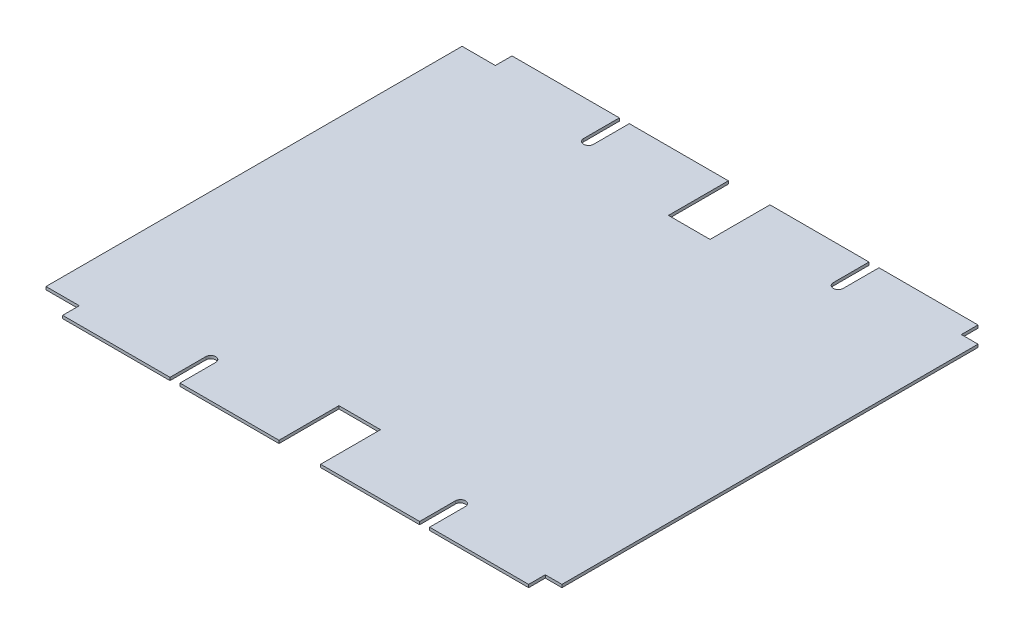
ISO-10303-21;
HEADER;
FILE_DESCRIPTION(('STEP AP214'),'2;1');
FILE_NAME('part.step','',(''),(''),'','','');
FILE_SCHEMA(('AUTOMOTIVE_DESIGN { 1 0 10303 214 1 1 1 1 }'));
ENDSEC;
DATA;
#1=APPLICATION_CONTEXT('core data for automotive mechanical design processes');
#2=APPLICATION_PROTOCOL_DEFINITION('international standard','automotive_design',2000,#1);
#3=PRODUCT_CONTEXT('',#1,'mechanical');
#4=PRODUCT('Part','Part','',(#3));
#5=PRODUCT_RELATED_PRODUCT_CATEGORY('part','',(#4));
#6=PRODUCT_DEFINITION_FORMATION('','',#4);
#7=PRODUCT_DEFINITION_CONTEXT('part definition',#1,'design');
#8=PRODUCT_DEFINITION('design','',#6,#7);
#9=PRODUCT_DEFINITION_SHAPE('','',#8);
#10=(LENGTH_UNIT() NAMED_UNIT(*) SI_UNIT(.MILLI.,.METRE.));
#11=(NAMED_UNIT(*) PLANE_ANGLE_UNIT() SI_UNIT($,.RADIAN.));
#12=(NAMED_UNIT(*) SI_UNIT($,.STERADIAN.) SOLID_ANGLE_UNIT());
#13=UNCERTAINTY_MEASURE_WITH_UNIT(LENGTH_MEASURE(1.E-05),#10,'distance_accuracy_value','');
#14=(GEOMETRIC_REPRESENTATION_CONTEXT(3) GLOBAL_UNCERTAINTY_ASSIGNED_CONTEXT((#13)) GLOBAL_UNIT_ASSIGNED_CONTEXT((#10,
#11,#12)) REPRESENTATION_CONTEXT('',''));
#15=CARTESIAN_POINT('',(0.,0.,0.));
#16=DIRECTION('',(0.,0.,1.));
#17=DIRECTION('',(1.,0.,0.));
#18=AXIS2_PLACEMENT_3D('',#15,#16,#17);
#19=CARTESIAN_POINT('',(-280.,3.5,270.));
#20=DIRECTION('',(0.,0.,-1.));
#21=DIRECTION('',(-1.,0.,0.));
#22=AXIS2_PLACEMENT_3D('',#19,#20,#21);
#23=PLANE('',#22);
#24=DIRECTION('',(1.,0.,0.));
#25=VECTOR('',#24,1.);
#26=CARTESIAN_POINT('',(-280.,3.5,270.));
#27=LINE('',#26,#25);
#28=CARTESIAN_POINT('',(-139.,3.5,270.));
#29=VERTEX_POINT('',#28);
#30=CARTESIAN_POINT('',(-19.9999999999999,3.5,270.));
#31=VERTEX_POINT('',#30);
#32=EDGE_CURVE('E412',#29,#31,#27,.T.);
#33=ORIENTED_EDGE('',*,*,#32,.F.);
#34=DIRECTION('',(0.,1.,0.));
#35=VECTOR('',#34,1.);
#36=CARTESIAN_POINT('',(-139.,-6.5,270.));
#37=LINE('',#36,#35);
#38=CARTESIAN_POINT('',(-139.,0.,270.));
#39=VERTEX_POINT('',#38);
#40=EDGE_CURVE('E316',#39,#29,#37,.T.);
#41=ORIENTED_EDGE('',*,*,#40,.F.);
#42=DIRECTION('',(1.,0.,0.));
#43=VECTOR('',#42,1.);
#44=CARTESIAN_POINT('',(-280.,0.,270.));
#45=LINE('',#44,#43);
#46=CARTESIAN_POINT('',(-19.9999999999999,0.,270.));
#47=VERTEX_POINT('',#46);
#48=EDGE_CURVE('E443',#39,#47,#45,.T.);
#49=ORIENTED_EDGE('',*,*,#48,.T.);
#50=DIRECTION('',(0.,1.,0.));
#51=VECTOR('',#50,1.);
#52=CARTESIAN_POINT('',(-19.9999999999999,-6.5,270.));
#53=LINE('',#52,#51);
#54=EDGE_CURVE('E389',#47,#31,#53,.T.);
#55=ORIENTED_EDGE('',*,*,#54,.T.);
#56=EDGE_LOOP('',(#33,#41,#49,#55));
#57=FACE_BOUND('',#56,.T.);
#58=ADVANCED_FACE('F37',(#57),#23,.F.);
#59=CARTESIAN_POINT('',(-280.,3.5,-270.));
#60=DIRECTION('',(0.,0.,1.));
#61=DIRECTION('',(1.,0.,0.));
#62=AXIS2_PLACEMENT_3D('',#59,#60,#61);
#63=PLANE('',#62);
#64=DIRECTION('',(-1.,0.,0.));
#65=VECTOR('',#64,1.);
#66=CARTESIAN_POINT('',(-280.,3.5,-270.));
#67=LINE('',#66,#65);
#68=CARTESIAN_POINT('',(-151.,3.5,-270.));
#69=VERTEX_POINT('',#68);
#70=CARTESIAN_POINT('',(-280.,3.5,-270.));
#71=VERTEX_POINT('',#70);
#72=EDGE_CURVE('E421',#69,#71,#67,.T.);
#73=ORIENTED_EDGE('',*,*,#72,.F.);
#74=DIRECTION('',(0.,1.,0.));
#75=VECTOR('',#74,1.);
#76=CARTESIAN_POINT('',(-151.,-6.5,-270.));
#77=LINE('',#76,#75);
#78=CARTESIAN_POINT('',(-151.,0.,-270.));
#79=VERTEX_POINT('',#78);
#80=EDGE_CURVE('E332',#79,#69,#77,.T.);
#81=ORIENTED_EDGE('',*,*,#80,.F.);
#82=DIRECTION('',(-1.,0.,0.));
#83=VECTOR('',#82,1.);
#84=CARTESIAN_POINT('',(-280.,0.,-270.));
#85=LINE('',#84,#83);
#86=CARTESIAN_POINT('',(-280.,0.,-270.));
#87=VERTEX_POINT('',#86);
#88=EDGE_CURVE('E453',#79,#87,#85,.T.);
#89=ORIENTED_EDGE('',*,*,#88,.T.);
#90=DIRECTION('',(0.,-1.,0.));
#91=VECTOR('',#90,1.);
#92=CARTESIAN_POINT('',(-280.,3.5,-270.));
#93=LINE('',#92,#91);
#94=EDGE_CURVE('E425',#71,#87,#93,.T.);
#95=ORIENTED_EDGE('',*,*,#94,.F.);
#96=EDGE_LOOP('',(#73,#81,#89,#95));
#97=FACE_BOUND('',#96,.T.);
#98=ADVANCED_FACE('F557',(#97),#63,.F.);
#99=CARTESIAN_POINT('',(161.,3.5,270.));
#100=VERTEX_POINT('',#99);
#101=CARTESIAN_POINT('',(280.,3.5,270.));
#102=VERTEX_POINT('',#101);
#103=EDGE_CURVE('E407',#100,#102,#27,.T.);
#104=ORIENTED_EDGE('',*,*,#103,.F.);
#105=DIRECTION('',(0.,1.,0.));
#106=VECTOR('',#105,1.);
#107=CARTESIAN_POINT('',(161.,-6.5,270.));
#108=LINE('',#107,#106);
#109=CARTESIAN_POINT('',(161.,0.,270.));
#110=VERTEX_POINT('',#109);
#111=EDGE_CURVE('E302',#110,#100,#108,.T.);
#112=ORIENTED_EDGE('',*,*,#111,.F.);
#113=CARTESIAN_POINT('',(280.,0.,270.));
#114=VERTEX_POINT('',#113);
#115=EDGE_CURVE('E438',#110,#114,#45,.T.);
#116=ORIENTED_EDGE('',*,*,#115,.T.);
#117=DIRECTION('',(0.,-1.,0.));
#118=VECTOR('',#117,1.);
#119=CARTESIAN_POINT('',(280.,3.5,270.));
#120=LINE('',#119,#118);
#121=EDGE_CURVE('E469',#102,#114,#120,.T.);
#122=ORIENTED_EDGE('',*,*,#121,.F.);
#123=EDGE_LOOP('',(#104,#112,#116,#122));
#124=FACE_BOUND('',#123,.T.);
#125=ADVANCED_FACE('F601',(#124),#23,.F.);
#126=CARTESIAN_POINT('',(149.,3.5,-270.));
#127=VERTEX_POINT('',#126);
#128=CARTESIAN_POINT('',(30.0000000000001,3.5,-270.));
#129=VERTEX_POINT('',#128);
#130=EDGE_CURVE('E426',#127,#129,#67,.T.);
#131=ORIENTED_EDGE('',*,*,#130,.F.);
#132=DIRECTION('',(0.,1.,0.));
#133=VECTOR('',#132,1.);
#134=CARTESIAN_POINT('',(149.,-6.5,-270.));
#135=LINE('',#134,#133);
#136=CARTESIAN_POINT('',(149.,0.,-270.));
#137=VERTEX_POINT('',#136);
#138=EDGE_CURVE('E347',#137,#127,#135,.T.);
#139=ORIENTED_EDGE('',*,*,#138,.F.);
#140=CARTESIAN_POINT('',(30.0000000000001,0.,-270.));
#141=VERTEX_POINT('',#140);
#142=EDGE_CURVE('E456',#137,#141,#85,.T.);
#143=ORIENTED_EDGE('',*,*,#142,.T.);
#144=DIRECTION('',(0.,1.,0.));
#145=VECTOR('',#144,1.);
#146=CARTESIAN_POINT('',(30.0000000000001,-6.5,-270.));
#147=LINE('',#146,#145);
#148=EDGE_CURVE('E368',#141,#129,#147,.T.);
#149=ORIENTED_EDGE('',*,*,#148,.T.);
#150=EDGE_LOOP('',(#131,#139,#143,#149));
#151=FACE_BOUND('',#150,.T.);
#152=ADVANCED_FACE('F579',(#151),#63,.F.);
#153=CARTESIAN_POINT('',(-280.,0.,270.));
#154=VERTEX_POINT('',#153);
#155=CARTESIAN_POINT('',(-151.,0.,270.));
#156=VERTEX_POINT('',#155);
#157=EDGE_CURVE('E439',#154,#156,#45,.T.);
#158=ORIENTED_EDGE('',*,*,#157,.T.);
#159=DIRECTION('',(0.,1.,0.));
#160=VECTOR('',#159,1.);
#161=CARTESIAN_POINT('',(-151.,-6.5,270.));
#162=LINE('',#161,#160);
#163=CARTESIAN_POINT('',(-151.,3.5,270.));
#164=VERTEX_POINT('',#163);
#165=EDGE_CURVE('E318',#156,#164,#162,.T.);
#166=ORIENTED_EDGE('',*,*,#165,.T.);
#167=CARTESIAN_POINT('',(-280.,3.5,270.));
#168=VERTEX_POINT('',#167);
#169=EDGE_CURVE('E408',#168,#164,#27,.T.);
#170=ORIENTED_EDGE('',*,*,#169,.F.);
#171=DIRECTION('',(0.,-1.,0.));
#172=VECTOR('',#171,1.);
#173=CARTESIAN_POINT('',(-280.,3.5,270.));
#174=LINE('',#173,#172);
#175=EDGE_CURVE('E472',#168,#154,#174,.T.);
#176=ORIENTED_EDGE('',*,*,#175,.T.);
#177=EDGE_LOOP('',(#158,#166,#170,#176));
#178=FACE_BOUND('',#177,.T.);
#179=ADVANCED_FACE('F613',(#178),#23,.F.);
#180=CARTESIAN_POINT('',(-19.9999999999999,0.,-270.));
#181=VERTEX_POINT('',#180);
#182=CARTESIAN_POINT('',(-139.,0.,-270.));
#183=VERTEX_POINT('',#182);
#184=EDGE_CURVE('E457',#181,#183,#85,.T.);
#185=ORIENTED_EDGE('',*,*,#184,.T.);
#186=DIRECTION('',(0.,1.,0.));
#187=VECTOR('',#186,1.);
#188=CARTESIAN_POINT('',(-139.,-6.5,-270.));
#189=LINE('',#188,#187);
#190=CARTESIAN_POINT('',(-139.,3.5,-270.));
#191=VERTEX_POINT('',#190);
#192=EDGE_CURVE('E60',#183,#191,#189,.T.);
#193=ORIENTED_EDGE('',*,*,#192,.T.);
#194=CARTESIAN_POINT('',(-19.9999999999999,3.5,-270.));
#195=VERTEX_POINT('',#194);
#196=EDGE_CURVE('E427',#195,#191,#67,.T.);
#197=ORIENTED_EDGE('',*,*,#196,.F.);
#198=DIRECTION('',(0.,1.,0.));
#199=VECTOR('',#198,1.);
#200=CARTESIAN_POINT('',(-19.9999999999999,-6.5,-270.));
#201=LINE('',#200,#199);
#202=EDGE_CURVE('E355',#181,#195,#201,.T.);
#203=ORIENTED_EDGE('',*,*,#202,.F.);
#204=EDGE_LOOP('',(#185,#193,#197,#203));
#205=FACE_BOUND('',#204,.T.);
#206=ADVANCED_FACE('F553',(#205),#63,.F.);
#207=CARTESIAN_POINT('',(-280.,3.5,-270.));
#208=DIRECTION('',(1.,0.,0.));
#209=DIRECTION('',(0.,0.,-1.));
#210=AXIS2_PLACEMENT_3D('',#207,#208,#209);
#211=PLANE('',#210);
#212=DIRECTION('',(0.,0.,1.));
#213=VECTOR('',#212,1.);
#214=CARTESIAN_POINT('',(-280.,0.,-270.));
#215=LINE('',#214,#213);
#216=CARTESIAN_POINT('',(-280.,0.,-250.));
#217=VERTEX_POINT('',#216);
#218=EDGE_CURVE('E388',#87,#217,#215,.T.);
#219=ORIENTED_EDGE('',*,*,#218,.T.);
#220=DIRECTION('',(0.,-1.,0.));
#221=VECTOR('',#220,1.);
#222=CARTESIAN_POINT('',(-280.,3.5,-250.));
#223=LINE('',#222,#221);
#224=CARTESIAN_POINT('',(-280.,3.5,-250.));
#225=VERTEX_POINT('',#224);
#226=EDGE_CURVE('E484',#225,#217,#223,.T.);
#227=ORIENTED_EDGE('',*,*,#226,.F.);
#228=DIRECTION('',(0.,0.,1.));
#229=VECTOR('',#228,1.);
#230=CARTESIAN_POINT('',(-280.,3.5,-270.));
#231=LINE('',#230,#229);
#232=EDGE_CURVE('E395',#71,#225,#231,.T.);
#233=ORIENTED_EDGE('',*,*,#232,.F.);
#234=ORIENTED_EDGE('',*,*,#94,.T.);
#235=EDGE_LOOP('',(#219,#227,#233,#234));
#236=FACE_BOUND('',#235,.T.);
#237=ADVANCED_FACE('F39',(#236),#211,.F.);
#238=CARTESIAN_POINT('',(-320.,3.5,-250.));
#239=DIRECTION('',(0.,0.,1.));
#240=DIRECTION('',(1.,0.,0.));
#241=AXIS2_PLACEMENT_3D('',#238,#239,#240);
#242=PLANE('',#241);
#243=DIRECTION('',(-1.,0.,0.));
#244=VECTOR('',#243,1.);
#245=CARTESIAN_POINT('',(-320.,0.,-250.));
#246=LINE('',#245,#244);
#247=CARTESIAN_POINT('',(-320.,0.,-250.));
#248=VERTEX_POINT('',#247);
#249=EDGE_CURVE('E430',#217,#248,#246,.T.);
#250=ORIENTED_EDGE('',*,*,#249,.T.);
#251=DIRECTION('',(0.,-1.,0.));
#252=VECTOR('',#251,1.);
#253=CARTESIAN_POINT('',(-320.,3.5,-250.));
#254=LINE('',#253,#252);
#255=CARTESIAN_POINT('',(-320.,3.5,-250.));
#256=VERTEX_POINT('',#255);
#257=EDGE_CURVE('E481',#256,#248,#254,.T.);
#258=ORIENTED_EDGE('',*,*,#257,.F.);
#259=DIRECTION('',(-1.,0.,0.));
#260=VECTOR('',#259,1.);
#261=CARTESIAN_POINT('',(-320.,3.5,-250.));
#262=LINE('',#261,#260);
#263=EDGE_CURVE('E398',#225,#256,#262,.T.);
#264=ORIENTED_EDGE('',*,*,#263,.F.);
#265=ORIENTED_EDGE('',*,*,#226,.T.);
#266=EDGE_LOOP('',(#250,#258,#264,#265));
#267=FACE_BOUND('',#266,.T.);
#268=ADVANCED_FACE('F566',(#267),#242,.F.);
#269=CARTESIAN_POINT('',(-320.,3.5,-250.));
#270=DIRECTION('',(1.,0.,0.));
#271=DIRECTION('',(0.,0.,-1.));
#272=AXIS2_PLACEMENT_3D('',#269,#270,#271);
#273=PLANE('',#272);
#274=DIRECTION('',(0.,0.,1.));
#275=VECTOR('',#274,1.);
#276=CARTESIAN_POINT('',(-320.,0.,-250.));
#277=LINE('',#276,#275);
#278=CARTESIAN_POINT('',(-320.,0.,250.));
#279=VERTEX_POINT('',#278);
#280=EDGE_CURVE('E432',#248,#279,#277,.T.);
#281=ORIENTED_EDGE('',*,*,#280,.T.);
#282=DIRECTION('',(0.,-1.,0.));
#283=VECTOR('',#282,1.);
#284=CARTESIAN_POINT('',(-320.,3.5,250.));
#285=LINE('',#284,#283);
#286=CARTESIAN_POINT('',(-320.,3.5,250.));
#287=VERTEX_POINT('',#286);
#288=EDGE_CURVE('E478',#287,#279,#285,.T.);
#289=ORIENTED_EDGE('',*,*,#288,.F.);
#290=DIRECTION('',(0.,0.,1.));
#291=VECTOR('',#290,1.);
#292=CARTESIAN_POINT('',(-320.,3.5,-250.));
#293=LINE('',#292,#291);
#294=EDGE_CURVE('E401',#256,#287,#293,.T.);
#295=ORIENTED_EDGE('',*,*,#294,.F.);
#296=ORIENTED_EDGE('',*,*,#257,.T.);
#297=EDGE_LOOP('',(#281,#289,#295,#296));
#298=FACE_BOUND('',#297,.T.);
#299=ADVANCED_FACE('F652',(#298),#273,.F.);
#300=CARTESIAN_POINT('',(-320.,3.5,250.));
#301=DIRECTION('',(0.,0.,-1.));
#302=DIRECTION('',(-1.,0.,0.));
#303=AXIS2_PLACEMENT_3D('',#300,#301,#302);
#304=PLANE('',#303);
#305=DIRECTION('',(1.,0.,0.));
#306=VECTOR('',#305,1.);
#307=CARTESIAN_POINT('',(-320.,0.,250.));
#308=LINE('',#307,#306);
#309=CARTESIAN_POINT('',(-280.,0.,250.));
#310=VERTEX_POINT('',#309);
#311=EDGE_CURVE('E434',#279,#310,#308,.T.);
#312=ORIENTED_EDGE('',*,*,#311,.T.);
#313=DIRECTION('',(0.,-1.,0.));
#314=VECTOR('',#313,1.);
#315=CARTESIAN_POINT('',(-280.,3.5,250.));
#316=LINE('',#315,#314);
#317=CARTESIAN_POINT('',(-280.,3.5,250.));
#318=VERTEX_POINT('',#317);
#319=EDGE_CURVE('E475',#318,#310,#316,.T.);
#320=ORIENTED_EDGE('',*,*,#319,.F.);
#321=DIRECTION('',(1.,0.,0.));
#322=VECTOR('',#321,1.);
#323=CARTESIAN_POINT('',(-320.,3.5,250.));
#324=LINE('',#323,#322);
#325=EDGE_CURVE('E403',#287,#318,#324,.T.);
#326=ORIENTED_EDGE('',*,*,#325,.F.);
#327=ORIENTED_EDGE('',*,*,#288,.T.);
#328=EDGE_LOOP('',(#312,#320,#326,#327));
#329=FACE_BOUND('',#328,.T.);
#330=ADVANCED_FACE('F624',(#329),#304,.F.);
#331=CARTESIAN_POINT('',(-280.,3.5,270.));
#332=DIRECTION('',(1.,0.,0.));
#333=DIRECTION('',(0.,0.,-1.));
#334=AXIS2_PLACEMENT_3D('',#331,#332,#333);
#335=PLANE('',#334);
#336=DIRECTION('',(0.,0.,1.));
#337=VECTOR('',#336,1.);
#338=CARTESIAN_POINT('',(-280.,0.,270.));
#339=LINE('',#338,#337);
#340=EDGE_CURVE('E436',#310,#154,#339,.T.);
#341=ORIENTED_EDGE('',*,*,#340,.T.);
#342=ORIENTED_EDGE('',*,*,#175,.F.);
#343=DIRECTION('',(0.,0.,1.));
#344=VECTOR('',#343,1.);
#345=CARTESIAN_POINT('',(-280.,3.5,270.));
#346=LINE('',#345,#344);
#347=EDGE_CURVE('E405',#318,#168,#346,.T.);
#348=ORIENTED_EDGE('',*,*,#347,.F.);
#349=ORIENTED_EDGE('',*,*,#319,.T.);
#350=EDGE_LOOP('',(#341,#342,#348,#349));
#351=FACE_BOUND('',#350,.T.);
#352=ADVANCED_FACE('F616',(#351),#335,.F.);
#353=CARTESIAN_POINT('',(30.0000000000001,0.,270.));
#354=VERTEX_POINT('',#353);
#355=CARTESIAN_POINT('',(149.,0.,270.));
#356=VERTEX_POINT('',#355);
#357=EDGE_CURVE('E444',#354,#356,#45,.T.);
#358=ORIENTED_EDGE('',*,*,#357,.T.);
#359=DIRECTION('',(0.,1.,0.));
#360=VECTOR('',#359,1.);
#361=CARTESIAN_POINT('',(149.,-6.5,270.));
#362=LINE('',#361,#360);
#363=CARTESIAN_POINT('',(149.,3.5,270.));
#364=VERTEX_POINT('',#363);
#365=EDGE_CURVE('E279',#356,#364,#362,.T.);
#366=ORIENTED_EDGE('',*,*,#365,.T.);
#367=CARTESIAN_POINT('',(30.0000000000001,3.5,270.));
#368=VERTEX_POINT('',#367);
#369=EDGE_CURVE('E296',#368,#364,#27,.T.);
#370=ORIENTED_EDGE('',*,*,#369,.F.);
#371=DIRECTION('',(0.,1.,0.));
#372=VECTOR('',#371,1.);
#373=CARTESIAN_POINT('',(30.0000000000001,-6.5,270.));
#374=LINE('',#373,#372);
#375=EDGE_CURVE('E386',#354,#368,#374,.T.);
#376=ORIENTED_EDGE('',*,*,#375,.F.);
#377=EDGE_LOOP('',(#358,#366,#370,#376));
#378=FACE_BOUND('',#377,.T.);
#379=ADVANCED_FACE('F602',(#378),#23,.F.);
#380=CARTESIAN_POINT('',(280.,3.5,270.));
#381=DIRECTION('',(-1.,0.,0.));
#382=DIRECTION('',(0.,0.,1.));
#383=AXIS2_PLACEMENT_3D('',#380,#381,#382);
#384=PLANE('',#383);
#385=DIRECTION('',(0.,0.,-1.));
#386=VECTOR('',#385,1.);
#387=CARTESIAN_POINT('',(280.,0.,270.));
#388=LINE('',#387,#386);
#389=CARTESIAN_POINT('',(280.,0.,250.));
#390=VERTEX_POINT('',#389);
#391=EDGE_CURVE('E442',#114,#390,#388,.T.);
#392=ORIENTED_EDGE('',*,*,#391,.T.);
#393=DIRECTION('',(0.,-1.,0.));
#394=VECTOR('',#393,1.);
#395=CARTESIAN_POINT('',(280.,3.5,250.));
#396=LINE('',#395,#394);
#397=CARTESIAN_POINT('',(280.,3.5,250.));
#398=VERTEX_POINT('',#397);
#399=EDGE_CURVE('E466',#398,#390,#396,.T.);
#400=ORIENTED_EDGE('',*,*,#399,.F.);
#401=DIRECTION('',(0.,0.,-1.));
#402=VECTOR('',#401,1.);
#403=CARTESIAN_POINT('',(280.,3.5,270.));
#404=LINE('',#403,#402);
#405=EDGE_CURVE('E411',#102,#398,#404,.T.);
#406=ORIENTED_EDGE('',*,*,#405,.F.);
#407=ORIENTED_EDGE('',*,*,#121,.T.);
#408=EDGE_LOOP('',(#392,#400,#406,#407));
#409=FACE_BOUND('',#408,.T.);
#410=ADVANCED_FACE('F615',(#409),#384,.F.);
#411=CARTESIAN_POINT('',(320.,3.5,250.));
#412=DIRECTION('',(0.,0.,-1.));
#413=DIRECTION('',(-1.,0.,0.));
#414=AXIS2_PLACEMENT_3D('',#411,#412,#413);
#415=PLANE('',#414);
#416=DIRECTION('',(1.,0.,0.));
#417=VECTOR('',#416,1.);
#418=CARTESIAN_POINT('',(320.,0.,250.));
#419=LINE('',#418,#417);
#420=CARTESIAN_POINT('',(300.,0.,250.));
#421=VERTEX_POINT('',#420);
#422=EDGE_CURVE('E446',#390,#421,#419,.T.);
#423=ORIENTED_EDGE('',*,*,#422,.T.);
#424=DIRECTION('',(0.,1.,0.));
#425=VECTOR('',#424,1.);
#426=CARTESIAN_POINT('',(300.,-6.5,250.));
#427=LINE('',#426,#425);
#428=CARTESIAN_POINT('',(300.,3.5,250.));
#429=VERTEX_POINT('',#428);
#430=EDGE_CURVE('E360',#421,#429,#427,.T.);
#431=ORIENTED_EDGE('',*,*,#430,.T.);
#432=DIRECTION('',(1.,0.,0.));
#433=VECTOR('',#432,1.);
#434=CARTESIAN_POINT('',(320.,3.5,250.));
#435=LINE('',#434,#433);
#436=EDGE_CURVE('E414',#398,#429,#435,.T.);
#437=ORIENTED_EDGE('',*,*,#436,.F.);
#438=ORIENTED_EDGE('',*,*,#399,.T.);
#439=EDGE_LOOP('',(#423,#431,#437,#438));
#440=FACE_BOUND('',#439,.T.);
#441=ADVANCED_FACE('F622',(#440),#415,.F.);
#442=CARTESIAN_POINT('',(320.,3.5,-250.));
#443=DIRECTION('',(0.,0.,1.));
#444=DIRECTION('',(1.,0.,0.));
#445=AXIS2_PLACEMENT_3D('',#442,#443,#444);
#446=PLANE('',#445);
#447=DIRECTION('',(-1.,0.,0.));
#448=VECTOR('',#447,1.);
#449=CARTESIAN_POINT('',(320.,3.5,-250.));
#450=LINE('',#449,#448);
#451=CARTESIAN_POINT('',(300.,3.5,-250.));
#452=VERTEX_POINT('',#451);
#453=CARTESIAN_POINT('',(280.,3.5,-250.));
#454=VERTEX_POINT('',#453);
#455=EDGE_CURVE('E417',#452,#454,#450,.T.);
#456=ORIENTED_EDGE('',*,*,#455,.F.);
#457=DIRECTION('',(0.,1.,0.));
#458=VECTOR('',#457,1.);
#459=CARTESIAN_POINT('',(300.,-6.5,-250.));
#460=LINE('',#459,#458);
#461=CARTESIAN_POINT('',(300.,0.,-250.));
#462=VERTEX_POINT('',#461);
#463=EDGE_CURVE('E351',#462,#452,#460,.T.);
#464=ORIENTED_EDGE('',*,*,#463,.F.);
#465=DIRECTION('',(-1.,0.,0.));
#466=VECTOR('',#465,1.);
#467=CARTESIAN_POINT('',(320.,0.,-250.));
#468=LINE('',#467,#466);
#469=CARTESIAN_POINT('',(280.,0.,-250.));
#470=VERTEX_POINT('',#469);
#471=EDGE_CURVE('E449',#462,#470,#468,.T.);
#472=ORIENTED_EDGE('',*,*,#471,.T.);
#473=DIRECTION('',(0.,-1.,0.));
#474=VECTOR('',#473,1.);
#475=CARTESIAN_POINT('',(280.,3.5,-250.));
#476=LINE('',#475,#474);
#477=EDGE_CURVE('E463',#454,#470,#476,.T.);
#478=ORIENTED_EDGE('',*,*,#477,.F.);
#479=EDGE_LOOP('',(#456,#464,#472,#478));
#480=FACE_BOUND('',#479,.T.);
#481=ADVANCED_FACE('F871',(#480),#446,.F.);
#482=CARTESIAN_POINT('',(280.,3.5,-270.));
#483=DIRECTION('',(-1.,0.,0.));
#484=DIRECTION('',(0.,0.,1.));
#485=AXIS2_PLACEMENT_3D('',#482,#483,#484);
#486=PLANE('',#485);
#487=DIRECTION('',(0.,0.,-1.));
#488=VECTOR('',#487,1.);
#489=CARTESIAN_POINT('',(280.,0.,-270.));
#490=LINE('',#489,#488);
#491=CARTESIAN_POINT('',(280.,0.,-270.));
#492=VERTEX_POINT('',#491);
#493=EDGE_CURVE('E451',#470,#492,#490,.T.);
#494=ORIENTED_EDGE('',*,*,#493,.T.);
#495=DIRECTION('',(0.,-1.,0.));
#496=VECTOR('',#495,1.);
#497=CARTESIAN_POINT('',(280.,3.5,-270.));
#498=LINE('',#497,#496);
#499=CARTESIAN_POINT('',(280.,3.5,-270.));
#500=VERTEX_POINT('',#499);
#501=EDGE_CURVE('E460',#500,#492,#498,.T.);
#502=ORIENTED_EDGE('',*,*,#501,.F.);
#503=DIRECTION('',(0.,0.,-1.));
#504=VECTOR('',#503,1.);
#505=CARTESIAN_POINT('',(280.,3.5,-270.));
#506=LINE('',#505,#504);
#507=EDGE_CURVE('E419',#454,#500,#506,.T.);
#508=ORIENTED_EDGE('',*,*,#507,.F.);
#509=ORIENTED_EDGE('',*,*,#477,.T.);
#510=EDGE_LOOP('',(#494,#502,#508,#509));
#511=FACE_BOUND('',#510,.T.);
#512=ADVANCED_FACE('F688',(#511),#486,.F.);
#513=CARTESIAN_POINT('',(161.,0.,-270.));
#514=VERTEX_POINT('',#513);
#515=EDGE_CURVE('E399',#492,#514,#85,.T.);
#516=ORIENTED_EDGE('',*,*,#515,.T.);
#517=DIRECTION('',(0.,1.,0.));
#518=VECTOR('',#517,1.);
#519=CARTESIAN_POINT('',(161.,-6.5,-270.));
#520=LINE('',#519,#518);
#521=CARTESIAN_POINT('',(161.,3.5,-270.));
#522=VERTEX_POINT('',#521);
#523=EDGE_CURVE('E52',#514,#522,#520,.T.);
#524=ORIENTED_EDGE('',*,*,#523,.T.);
#525=EDGE_CURVE('E422',#500,#522,#67,.T.);
#526=ORIENTED_EDGE('',*,*,#525,.F.);
#527=ORIENTED_EDGE('',*,*,#501,.T.);
#528=EDGE_LOOP('',(#516,#524,#526,#527));
#529=FACE_BOUND('',#528,.T.);
#530=ADVANCED_FACE('F607',(#529),#63,.F.);
#531=CARTESIAN_POINT('',(0.,3.5,0.));
#532=DIRECTION('',(0.,1.,0.));
#533=DIRECTION('',(0.,0.,1.));
#534=AXIS2_PLACEMENT_3D('',#531,#532,#533);
#535=PLANE('',#534);
#536=DIRECTION('',(0.,0.,1.));
#537=VECTOR('',#536,1.);
#538=CARTESIAN_POINT('',(300.,3.5,250.));
#539=LINE('',#538,#537);
#540=EDGE_CURVE('E346',#452,#429,#539,.T.);
#541=ORIENTED_EDGE('',*,*,#540,.F.);
#542=ORIENTED_EDGE('',*,*,#455,.T.);
#543=ORIENTED_EDGE('',*,*,#507,.T.);
#544=ORIENTED_EDGE('',*,*,#525,.T.);
#545=DIRECTION('',(0.,0.,-1.));
#546=VECTOR('',#545,1.);
#547=CARTESIAN_POINT('',(161.,3.5,-227.));
#548=LINE('',#547,#546);
#549=CARTESIAN_POINT('',(161.,3.5,-227.));
#550=VERTEX_POINT('',#549);
#551=EDGE_CURVE('E338',#550,#522,#548,.T.);
#552=ORIENTED_EDGE('',*,*,#551,.F.);
#553=CARTESIAN_POINT('',(155.,3.5,-227.));
#554=DIRECTION('',(0.,1.,0.));
#555=DIRECTION('',(0.,0.,1.));
#556=AXIS2_PLACEMENT_3D('',#553,#554,#555);
#557=CIRCLE('',#556,6.00000000000001);
#558=CARTESIAN_POINT('',(149.,3.5,-227.));
#559=VERTEX_POINT('',#558);
#560=EDGE_CURVE('E301',#559,#550,#557,.T.);
#561=ORIENTED_EDGE('',*,*,#560,.F.);
#562=DIRECTION('',(0.,0.,1.));
#563=VECTOR('',#562,1.);
#564=CARTESIAN_POINT('',(149.,3.5,-227.));
#565=LINE('',#564,#563);
#566=EDGE_CURVE('E340',#127,#559,#565,.T.);
#567=ORIENTED_EDGE('',*,*,#566,.F.);
#568=ORIENTED_EDGE('',*,*,#130,.T.);
#569=DIRECTION('',(0.,0.,-1.));
#570=VECTOR('',#569,1.);
#571=CARTESIAN_POINT('',(30.0000000000001,3.5,-250.));
#572=LINE('',#571,#570);
#573=CARTESIAN_POINT('',(30.0000000000001,3.5,-198.));
#574=VERTEX_POINT('',#573);
#575=EDGE_CURVE('E359',#574,#129,#572,.T.);
#576=ORIENTED_EDGE('',*,*,#575,.F.);
#577=DIRECTION('',(1.,0.,0.));
#578=VECTOR('',#577,1.);
#579=CARTESIAN_POINT('',(-19.9999999999999,3.5,-198.));
#580=LINE('',#579,#578);
#581=CARTESIAN_POINT('',(-19.9999999999999,3.5,-198.));
#582=VERTEX_POINT('',#581);
#583=EDGE_CURVE('E356',#582,#574,#580,.T.);
#584=ORIENTED_EDGE('',*,*,#583,.F.);
#585=DIRECTION('',(0.,0.,1.));
#586=VECTOR('',#585,1.);
#587=CARTESIAN_POINT('',(-19.9999999999999,3.5,-250.));
#588=LINE('',#587,#586);
#589=EDGE_CURVE('E363',#195,#582,#588,.T.);
#590=ORIENTED_EDGE('',*,*,#589,.F.);
#591=ORIENTED_EDGE('',*,*,#196,.T.);
#592=DIRECTION('',(0.,0.,-1.));
#593=VECTOR('',#592,1.);
#594=CARTESIAN_POINT('',(-139.,3.5,-227.));
#595=LINE('',#594,#593);
#596=CARTESIAN_POINT('',(-139.,3.5,-227.));
#597=VERTEX_POINT('',#596);
#598=EDGE_CURVE('E325',#597,#191,#595,.T.);
#599=ORIENTED_EDGE('',*,*,#598,.F.);
#600=CARTESIAN_POINT('',(-145.,3.5,-227.));
#601=DIRECTION('',(0.,1.,0.));
#602=DIRECTION('',(0.,0.,-1.));
#603=AXIS2_PLACEMENT_3D('',#600,#601,#602);
#604=CIRCLE('',#603,6.00000000000001);
#605=CARTESIAN_POINT('',(-151.,3.5,-227.));
#606=VERTEX_POINT('',#605);
#607=EDGE_CURVE('E322',#606,#597,#604,.T.);
#608=ORIENTED_EDGE('',*,*,#607,.F.);
#609=DIRECTION('',(0.,0.,1.));
#610=VECTOR('',#609,1.);
#611=CARTESIAN_POINT('',(-151.,3.5,-227.));
#612=LINE('',#611,#610);
#613=EDGE_CURVE('E327',#69,#606,#612,.T.);
#614=ORIENTED_EDGE('',*,*,#613,.F.);
#615=ORIENTED_EDGE('',*,*,#72,.T.);
#616=ORIENTED_EDGE('',*,*,#232,.T.);
#617=ORIENTED_EDGE('',*,*,#263,.T.);
#618=ORIENTED_EDGE('',*,*,#294,.T.);
#619=ORIENTED_EDGE('',*,*,#325,.T.);
#620=ORIENTED_EDGE('',*,*,#347,.T.);
#621=ORIENTED_EDGE('',*,*,#169,.T.);
#622=DIRECTION('',(0.,0.,1.));
#623=VECTOR('',#622,1.);
#624=CARTESIAN_POINT('',(-151.,3.5,227.));
#625=LINE('',#624,#623);
#626=CARTESIAN_POINT('',(-151.,3.5,227.));
#627=VERTEX_POINT('',#626);
#628=EDGE_CURVE('E308',#627,#164,#625,.T.);
#629=ORIENTED_EDGE('',*,*,#628,.F.);
#630=CARTESIAN_POINT('',(-145.,3.5,227.));
#631=DIRECTION('',(0.,1.,0.));
#632=DIRECTION('',(0.,0.,1.));
#633=AXIS2_PLACEMENT_3D('',#630,#631,#632);
#634=CIRCLE('',#633,6.00000000000001);
#635=CARTESIAN_POINT('',(-139.,3.5,227.));
#636=VERTEX_POINT('',#635);
#637=EDGE_CURVE('E305',#636,#627,#634,.T.);
#638=ORIENTED_EDGE('',*,*,#637,.F.);
#639=DIRECTION('',(0.,0.,-1.));
#640=VECTOR('',#639,1.);
#641=CARTESIAN_POINT('',(-139.,3.5,227.));
#642=LINE('',#641,#640);
#643=EDGE_CURVE('E311',#29,#636,#642,.T.);
#644=ORIENTED_EDGE('',*,*,#643,.F.);
#645=ORIENTED_EDGE('',*,*,#32,.T.);
#646=DIRECTION('',(0.,0.,1.));
#647=VECTOR('',#646,1.);
#648=CARTESIAN_POINT('',(-19.9999999999999,3.5,250.));
#649=LINE('',#648,#647);
#650=CARTESIAN_POINT('',(-19.9999999999999,3.5,198.));
#651=VERTEX_POINT('',#650);
#652=EDGE_CURVE('E382',#651,#31,#649,.T.);
#653=ORIENTED_EDGE('',*,*,#652,.F.);
#654=DIRECTION('',(-1.,0.,0.));
#655=VECTOR('',#654,1.);
#656=CARTESIAN_POINT('',(30.0000000000001,3.5,198.));
#657=LINE('',#656,#655);
#658=CARTESIAN_POINT('',(30.0000000000001,3.5,198.));
#659=VERTEX_POINT('',#658);
#660=EDGE_CURVE('E379',#659,#651,#657,.T.);
#661=ORIENTED_EDGE('',*,*,#660,.F.);
#662=DIRECTION('',(0.,0.,-1.));
#663=VECTOR('',#662,1.);
#664=CARTESIAN_POINT('',(30.0000000000001,3.5,250.));
#665=LINE('',#664,#663);
#666=EDGE_CURVE('E354',#368,#659,#665,.T.);
#667=ORIENTED_EDGE('',*,*,#666,.F.);
#668=ORIENTED_EDGE('',*,*,#369,.T.);
#669=DIRECTION('',(0.,0.,1.));
#670=VECTOR('',#669,1.);
#671=CARTESIAN_POINT('',(149.,3.5,227.));
#672=LINE('',#671,#670);
#673=CARTESIAN_POINT('',(149.,3.5,227.));
#674=VERTEX_POINT('',#673);
#675=EDGE_CURVE('E273',#674,#364,#672,.T.);
#676=ORIENTED_EDGE('',*,*,#675,.F.);
#677=CARTESIAN_POINT('',(155.,3.5,227.));
#678=DIRECTION('',(0.,1.,0.));
#679=DIRECTION('',(0.,0.,-1.));
#680=AXIS2_PLACEMENT_3D('',#677,#678,#679);
#681=CIRCLE('',#680,6.00000000000001);
#682=CARTESIAN_POINT('',(161.,3.5,227.));
#683=VERTEX_POINT('',#682);
#684=EDGE_CURVE('E283',#683,#674,#681,.T.);
#685=ORIENTED_EDGE('',*,*,#684,.F.);
#686=DIRECTION('',(0.,0.,-1.));
#687=VECTOR('',#686,1.);
#688=CARTESIAN_POINT('',(161.,3.5,227.));
#689=LINE('',#688,#687);
#690=EDGE_CURVE('E280',#100,#683,#689,.T.);
#691=ORIENTED_EDGE('',*,*,#690,.F.);
#692=ORIENTED_EDGE('',*,*,#103,.T.);
#693=ORIENTED_EDGE('',*,*,#405,.T.);
#694=ORIENTED_EDGE('',*,*,#436,.T.);
#695=EDGE_LOOP('',(#541,#542,#543,#544,#552,#561,#567,#568,#576,#584,#590,#591,#599,#608,#614,
#615,#616,#617,#618,#619,#620,#621,#629,#638,#644,#645,#653,#661,#667,#668,#676,#685,#691,#692,
#693,#694));
#696=FACE_BOUND('',#695,.T.);
#697=ADVANCED_FACE('F293',(#696),#535,.T.);
#698=CARTESIAN_POINT('',(0.,0.,0.));
#699=DIRECTION('',(0.,1.,0.));
#700=DIRECTION('',(0.,0.,1.));
#701=AXIS2_PLACEMENT_3D('',#698,#699,#700);
#702=PLANE('',#701);
#703=DIRECTION('',(0.,0.,1.));
#704=VECTOR('',#703,1.);
#705=CARTESIAN_POINT('',(300.,0.,0.));
#706=LINE('',#705,#704);
#707=EDGE_CURVE('E496',#462,#421,#706,.T.);
#708=ORIENTED_EDGE('',*,*,#707,.T.);
#709=ORIENTED_EDGE('',*,*,#422,.F.);
#710=ORIENTED_EDGE('',*,*,#391,.F.);
#711=ORIENTED_EDGE('',*,*,#115,.F.);
#712=DIRECTION('',(0.,0.,-1.));
#713=VECTOR('',#712,1.);
#714=CARTESIAN_POINT('',(161.,0.,-2.07844077865872E-13));
#715=LINE('',#714,#713);
#716=CARTESIAN_POINT('',(161.,0.,227.));
#717=VERTEX_POINT('',#716);
#718=EDGE_CURVE('E518',#110,#717,#715,.T.);
#719=ORIENTED_EDGE('',*,*,#718,.T.);
#720=CARTESIAN_POINT('',(155.,0.,227.));
#721=DIRECTION('',(0.,1.,0.));
#722=DIRECTION('',(0.,0.,1.));
#723=AXIS2_PLACEMENT_3D('',#720,#721,#722);
#724=CIRCLE('',#723,6.00000000000001);
#725=CARTESIAN_POINT('',(149.,0.,227.));
#726=VERTEX_POINT('',#725);
#727=EDGE_CURVE('E516',#717,#726,#724,.T.);
#728=ORIENTED_EDGE('',*,*,#727,.T.);
#729=DIRECTION('',(0.,0.,1.));
#730=VECTOR('',#729,1.);
#731=CARTESIAN_POINT('',(149.,0.,-1.92352593801335E-13));
#732=LINE('',#731,#730);
#733=EDGE_CURVE('E276',#726,#356,#732,.T.);
#734=ORIENTED_EDGE('',*,*,#733,.T.);
#735=ORIENTED_EDGE('',*,*,#357,.F.);
#736=DIRECTION('',(0.,0.,-1.));
#737=VECTOR('',#736,1.);
#738=CARTESIAN_POINT('',(30.0000000000001,0.,0.));
#739=LINE('',#738,#737);
#740=CARTESIAN_POINT('',(30.0000000000001,0.,198.));
#741=VERTEX_POINT('',#740);
#742=EDGE_CURVE('E487',#354,#741,#739,.T.);
#743=ORIENTED_EDGE('',*,*,#742,.T.);
#744=DIRECTION('',(-1.,0.,0.));
#745=VECTOR('',#744,1.);
#746=CARTESIAN_POINT('',(0.,0.,198.));
#747=LINE('',#746,#745);
#748=CARTESIAN_POINT('',(-19.9999999999999,0.,198.));
#749=VERTEX_POINT('',#748);
#750=EDGE_CURVE('E490',#741,#749,#747,.T.);
#751=ORIENTED_EDGE('',*,*,#750,.T.);
#752=DIRECTION('',(0.,0.,1.));
#753=VECTOR('',#752,1.);
#754=CARTESIAN_POINT('',(-19.9999999999999,0.,0.));
#755=LINE('',#754,#753);
#756=EDGE_CURVE('E493',#749,#47,#755,.T.);
#757=ORIENTED_EDGE('',*,*,#756,.T.);
#758=ORIENTED_EDGE('',*,*,#48,.F.);
#759=DIRECTION('',(0.,0.,-1.));
#760=VECTOR('',#759,1.);
#761=CARTESIAN_POINT('',(-139.,0.,-1.79443023747554E-13));
#762=LINE('',#761,#760);
#763=CARTESIAN_POINT('',(-139.,0.,227.));
#764=VERTEX_POINT('',#763);
#765=EDGE_CURVE('E527',#39,#764,#762,.T.);
#766=ORIENTED_EDGE('',*,*,#765,.T.);
#767=CARTESIAN_POINT('',(-145.,0.,227.));
#768=DIRECTION('',(0.,1.,0.));
#769=DIRECTION('',(0.,0.,1.));
#770=AXIS2_PLACEMENT_3D('',#767,#768,#769);
#771=CIRCLE('',#770,6.00000000000001);
#772=CARTESIAN_POINT('',(-151.,0.,227.));
#773=VERTEX_POINT('',#772);
#774=EDGE_CURVE('E524',#764,#773,#771,.T.);
#775=ORIENTED_EDGE('',*,*,#774,.T.);
#776=DIRECTION('',(0.,0.,1.));
#777=VECTOR('',#776,1.);
#778=CARTESIAN_POINT('',(-151.,0.,-1.94934507812091E-13));
#779=LINE('',#778,#777);
#780=EDGE_CURVE('E521',#773,#156,#779,.T.);
#781=ORIENTED_EDGE('',*,*,#780,.T.);
#782=ORIENTED_EDGE('',*,*,#157,.F.);
#783=ORIENTED_EDGE('',*,*,#340,.F.);
#784=ORIENTED_EDGE('',*,*,#311,.F.);
#785=ORIENTED_EDGE('',*,*,#280,.F.);
#786=ORIENTED_EDGE('',*,*,#249,.F.);
#787=ORIENTED_EDGE('',*,*,#218,.F.);
#788=ORIENTED_EDGE('',*,*,#88,.F.);
#789=DIRECTION('',(0.,0.,1.));
#790=VECTOR('',#789,1.);
#791=CARTESIAN_POINT('',(-151.,0.,0.));
#792=LINE('',#791,#790);
#793=CARTESIAN_POINT('',(-151.,0.,-227.));
#794=VERTEX_POINT('',#793);
#795=EDGE_CURVE('E11',#79,#794,#792,.T.);
#796=ORIENTED_EDGE('',*,*,#795,.T.);
#797=CARTESIAN_POINT('',(-145.,0.,-227.));
#798=DIRECTION('',(0.,1.,0.));
#799=DIRECTION('',(0.,0.,1.));
#800=AXIS2_PLACEMENT_3D('',#797,#798,#799);
#801=CIRCLE('',#800,6.00000000000001);
#802=CARTESIAN_POINT('',(-139.,0.,-227.));
#803=VERTEX_POINT('',#802);
#804=EDGE_CURVE('E45',#794,#803,#801,.T.);
#805=ORIENTED_EDGE('',*,*,#804,.T.);
#806=DIRECTION('',(0.,0.,-1.));
#807=VECTOR('',#806,1.);
#808=CARTESIAN_POINT('',(-139.,0.,0.));
#809=LINE('',#808,#807);
#810=EDGE_CURVE('E530',#803,#183,#809,.T.);
#811=ORIENTED_EDGE('',*,*,#810,.T.);
#812=ORIENTED_EDGE('',*,*,#184,.F.);
#813=DIRECTION('',(0.,0.,1.));
#814=VECTOR('',#813,1.);
#815=CARTESIAN_POINT('',(-19.9999999999999,0.,0.));
#816=LINE('',#815,#814);
#817=CARTESIAN_POINT('',(-19.9999999999999,0.,-198.));
#818=VERTEX_POINT('',#817);
#819=EDGE_CURVE('E504',#181,#818,#816,.T.);
#820=ORIENTED_EDGE('',*,*,#819,.T.);
#821=DIRECTION('',(1.,0.,0.));
#822=VECTOR('',#821,1.);
#823=CARTESIAN_POINT('',(0.,0.,-198.));
#824=LINE('',#823,#822);
#825=CARTESIAN_POINT('',(30.0000000000001,0.,-198.));
#826=VERTEX_POINT('',#825);
#827=EDGE_CURVE('E498',#818,#826,#824,.T.);
#828=ORIENTED_EDGE('',*,*,#827,.T.);
#829=DIRECTION('',(0.,0.,-1.));
#830=VECTOR('',#829,1.);
#831=CARTESIAN_POINT('',(30.0000000000001,0.,0.));
#832=LINE('',#831,#830);
#833=EDGE_CURVE('E501',#826,#141,#832,.T.);
#834=ORIENTED_EDGE('',*,*,#833,.T.);
#835=ORIENTED_EDGE('',*,*,#142,.F.);
#836=DIRECTION('',(0.,0.,1.));
#837=VECTOR('',#836,1.);
#838=CARTESIAN_POINT('',(149.,0.,0.));
#839=LINE('',#838,#837);
#840=CARTESIAN_POINT('',(149.,0.,-227.));
#841=VERTEX_POINT('',#840);
#842=EDGE_CURVE('E512',#137,#841,#839,.T.);
#843=ORIENTED_EDGE('',*,*,#842,.T.);
#844=CARTESIAN_POINT('',(155.,0.,-227.));
#845=DIRECTION('',(0.,1.,0.));
#846=DIRECTION('',(0.,0.,1.));
#847=AXIS2_PLACEMENT_3D('',#844,#845,#846);
#848=CIRCLE('',#847,6.00000000000001);
#849=CARTESIAN_POINT('',(161.,0.,-227.));
#850=VERTEX_POINT('',#849);
#851=EDGE_CURVE('E509',#841,#850,#848,.T.);
#852=ORIENTED_EDGE('',*,*,#851,.T.);
#853=DIRECTION('',(0.,0.,-1.));
#854=VECTOR('',#853,1.);
#855=CARTESIAN_POINT('',(161.,0.,0.));
#856=LINE('',#855,#854);
#857=EDGE_CURVE('E507',#850,#514,#856,.T.);
#858=ORIENTED_EDGE('',*,*,#857,.T.);
#859=ORIENTED_EDGE('',*,*,#515,.F.);
#860=ORIENTED_EDGE('',*,*,#493,.F.);
#861=ORIENTED_EDGE('',*,*,#471,.F.);
#862=EDGE_LOOP('',(#708,#709,#710,#711,#719,#728,#734,#735,#743,#751,#757,#758,#766,#775,#781,
#782,#783,#784,#785,#786,#787,#788,#796,#805,#811,#812,#820,#828,#834,#835,#843,#852,#858,#859,
#860,#861));
#863=FACE_BOUND('',#862,.T.);
#864=ADVANCED_FACE('F533',(#863),#702,.F.);
#865=CARTESIAN_POINT('',(-19.9999999999999,-6.5,250.));
#866=DIRECTION('',(-1.,0.,0.));
#867=DIRECTION('',(0.,0.,1.));
#868=AXIS2_PLACEMENT_3D('',#865,#866,#867);
#869=PLANE('',#868);
#870=DIRECTION('',(0.,1.,0.));
#871=VECTOR('',#870,1.);
#872=CARTESIAN_POINT('',(-19.9999999999999,-6.5,198.));
#873=LINE('',#872,#871);
#874=EDGE_CURVE('E392',#749,#651,#873,.T.);
#875=ORIENTED_EDGE('',*,*,#874,.T.);
#876=ORIENTED_EDGE('',*,*,#652,.T.);
#877=ORIENTED_EDGE('',*,*,#54,.F.);
#878=ORIENTED_EDGE('',*,*,#756,.F.);
#879=EDGE_LOOP('',(#875,#876,#877,#878));
#880=FACE_BOUND('',#879,.T.);
#881=ADVANCED_FACE('F814',(#880),#869,.F.);
#882=CARTESIAN_POINT('',(30.0000000000001,-6.5,198.));
#883=DIRECTION('',(0.,0.,-1.));
#884=DIRECTION('',(-1.,0.,0.));
#885=AXIS2_PLACEMENT_3D('',#882,#883,#884);
#886=PLANE('',#885);
#887=DIRECTION('',(0.,1.,0.));
#888=VECTOR('',#887,1.);
#889=CARTESIAN_POINT('',(30.0000000000001,-6.5,198.));
#890=LINE('',#889,#888);
#891=EDGE_CURVE('E385',#741,#659,#890,.T.);
#892=ORIENTED_EDGE('',*,*,#891,.T.);
#893=ORIENTED_EDGE('',*,*,#660,.T.);
#894=ORIENTED_EDGE('',*,*,#874,.F.);
#895=ORIENTED_EDGE('',*,*,#750,.F.);
#896=EDGE_LOOP('',(#892,#893,#894,#895));
#897=FACE_BOUND('',#896,.T.);
#898=ADVANCED_FACE('F594',(#897),#886,.F.);
#899=CARTESIAN_POINT('',(30.0000000000001,-6.5,250.));
#900=DIRECTION('',(1.,0.,0.));
#901=DIRECTION('',(0.,0.,-1.));
#902=AXIS2_PLACEMENT_3D('',#899,#900,#901);
#903=PLANE('',#902);
#904=ORIENTED_EDGE('',*,*,#375,.T.);
#905=ORIENTED_EDGE('',*,*,#666,.T.);
#906=ORIENTED_EDGE('',*,*,#891,.F.);
#907=ORIENTED_EDGE('',*,*,#742,.F.);
#908=EDGE_LOOP('',(#904,#905,#906,#907));
#909=FACE_BOUND('',#908,.T.);
#910=ADVANCED_FACE('F587',(#909),#903,.F.);
#911=CARTESIAN_POINT('',(-19.9999999999999,-6.5,-250.));
#912=DIRECTION('',(-1.,0.,0.));
#913=DIRECTION('',(0.,0.,1.));
#914=AXIS2_PLACEMENT_3D('',#911,#912,#913);
#915=PLANE('',#914);
#916=ORIENTED_EDGE('',*,*,#202,.T.);
#917=ORIENTED_EDGE('',*,*,#589,.T.);
#918=DIRECTION('',(0.,1.,0.));
#919=VECTOR('',#918,1.);
#920=CARTESIAN_POINT('',(-19.9999999999999,-6.5,-198.));
#921=LINE('',#920,#919);
#922=EDGE_CURVE('E366',#818,#582,#921,.T.);
#923=ORIENTED_EDGE('',*,*,#922,.F.);
#924=ORIENTED_EDGE('',*,*,#819,.F.);
#925=EDGE_LOOP('',(#916,#917,#923,#924));
#926=FACE_BOUND('',#925,.T.);
#927=ADVANCED_FACE('F585',(#926),#915,.F.);
#928=CARTESIAN_POINT('',(30.0000000000001,-6.5,-250.));
#929=DIRECTION('',(1.,0.,0.));
#930=DIRECTION('',(0.,0.,-1.));
#931=AXIS2_PLACEMENT_3D('',#928,#929,#930);
#932=PLANE('',#931);
#933=DIRECTION('',(0.,1.,0.));
#934=VECTOR('',#933,1.);
#935=CARTESIAN_POINT('',(30.0000000000001,-6.5,-198.));
#936=LINE('',#935,#934);
#937=EDGE_CURVE('E371',#826,#574,#936,.T.);
#938=ORIENTED_EDGE('',*,*,#937,.T.);
#939=ORIENTED_EDGE('',*,*,#575,.T.);
#940=ORIENTED_EDGE('',*,*,#148,.F.);
#941=ORIENTED_EDGE('',*,*,#833,.F.);
#942=EDGE_LOOP('',(#938,#939,#940,#941));
#943=FACE_BOUND('',#942,.T.);
#944=ADVANCED_FACE('F577',(#943),#932,.F.);
#945=CARTESIAN_POINT('',(-19.9999999999999,-6.5,-198.));
#946=DIRECTION('',(0.,0.,1.));
#947=DIRECTION('',(1.,0.,0.));
#948=AXIS2_PLACEMENT_3D('',#945,#946,#947);
#949=PLANE('',#948);
#950=ORIENTED_EDGE('',*,*,#922,.T.);
#951=ORIENTED_EDGE('',*,*,#583,.T.);
#952=ORIENTED_EDGE('',*,*,#937,.F.);
#953=ORIENTED_EDGE('',*,*,#827,.F.);
#954=EDGE_LOOP('',(#950,#951,#952,#953));
#955=FACE_BOUND('',#954,.T.);
#956=ADVANCED_FACE('F583',(#955),#949,.F.);
#957=CARTESIAN_POINT('',(300.,-6.5,250.));
#958=DIRECTION('',(-1.,0.,0.));
#959=DIRECTION('',(0.,0.,1.));
#960=AXIS2_PLACEMENT_3D('',#957,#958,#959);
#961=PLANE('',#960);
#962=ORIENTED_EDGE('',*,*,#430,.F.);
#963=ORIENTED_EDGE('',*,*,#707,.F.);
#964=ORIENTED_EDGE('',*,*,#463,.T.);
#965=ORIENTED_EDGE('',*,*,#540,.T.);
#966=EDGE_LOOP('',(#962,#963,#964,#965));
#967=FACE_BOUND('',#966,.T.);
#968=ADVANCED_FACE('F703',(#967),#961,.F.);
#969=CARTESIAN_POINT('',(155.,-6.5,-227.));
#970=DIRECTION('',(0.,1.,0.));
#971=DIRECTION('',(0.,0.,1.));
#972=AXIS2_PLACEMENT_3D('',#969,#970,#971);
#973=CYLINDRICAL_SURFACE('',#972,6.00000000000001);
#974=DIRECTION('',(0.,1.,0.));
#975=VECTOR('',#974,1.);
#976=CARTESIAN_POINT('',(149.,-6.5,-227.));
#977=LINE('',#976,#975);
#978=EDGE_CURVE('E344',#841,#559,#977,.T.);
#979=ORIENTED_EDGE('',*,*,#978,.T.);
#980=ORIENTED_EDGE('',*,*,#560,.T.);
#981=DIRECTION('',(0.,1.,0.));
#982=VECTOR('',#981,1.);
#983=CARTESIAN_POINT('',(161.,-6.5,-227.));
#984=LINE('',#983,#982);
#985=EDGE_CURVE('E343',#850,#550,#984,.T.);
#986=ORIENTED_EDGE('',*,*,#985,.F.);
#987=ORIENTED_EDGE('',*,*,#851,.F.);
#988=EDGE_LOOP('',(#979,#980,#986,#987));
#989=FACE_BOUND('',#988,.T.);
#990=ADVANCED_FACE('F697',(#989),#973,.F.);
#991=CARTESIAN_POINT('',(149.,-6.5,-227.));
#992=DIRECTION('',(-1.,0.,0.));
#993=DIRECTION('',(0.,0.,1.));
#994=AXIS2_PLACEMENT_3D('',#991,#992,#993);
#995=PLANE('',#994);
#996=ORIENTED_EDGE('',*,*,#138,.T.);
#997=ORIENTED_EDGE('',*,*,#566,.T.);
#998=ORIENTED_EDGE('',*,*,#978,.F.);
#999=ORIENTED_EDGE('',*,*,#842,.F.);
#1000=EDGE_LOOP('',(#996,#997,#998,#999));
#1001=FACE_BOUND('',#1000,.T.);
#1002=ADVANCED_FACE('F702',(#1001),#995,.F.);
#1003=CARTESIAN_POINT('',(161.,-6.5,-227.));
#1004=DIRECTION('',(1.,0.,0.));
#1005=DIRECTION('',(0.,0.,-1.));
#1006=AXIS2_PLACEMENT_3D('',#1003,#1004,#1005);
#1007=PLANE('',#1006);
#1008=ORIENTED_EDGE('',*,*,#985,.T.);
#1009=ORIENTED_EDGE('',*,*,#551,.T.);
#1010=ORIENTED_EDGE('',*,*,#523,.F.);
#1011=ORIENTED_EDGE('',*,*,#857,.F.);
#1012=EDGE_LOOP('',(#1008,#1009,#1010,#1011));
#1013=FACE_BOUND('',#1012,.T.);
#1014=ADVANCED_FACE('F714',(#1013),#1007,.F.);
#1015=CARTESIAN_POINT('',(155.,-6.5,227.));
#1016=DIRECTION('',(0.,1.,0.));
#1017=DIRECTION('',(0.,0.,1.));
#1018=AXIS2_PLACEMENT_3D('',#1015,#1016,#1017);
#1019=CYLINDRICAL_SURFACE('',#1018,6.00000000000001);
#1020=DIRECTION('',(0.,1.,0.));
#1021=VECTOR('',#1020,1.);
#1022=CARTESIAN_POINT('',(161.,-6.5,227.));
#1023=LINE('',#1022,#1021);
#1024=EDGE_CURVE('E286',#717,#683,#1023,.T.);
#1025=ORIENTED_EDGE('',*,*,#1024,.T.);
#1026=ORIENTED_EDGE('',*,*,#684,.T.);
#1027=DIRECTION('',(0.,1.,0.));
#1028=VECTOR('',#1027,1.);
#1029=CARTESIAN_POINT('',(149.,-6.5,227.));
#1030=LINE('',#1029,#1028);
#1031=EDGE_CURVE('E269',#726,#674,#1030,.T.);
#1032=ORIENTED_EDGE('',*,*,#1031,.F.);
#1033=ORIENTED_EDGE('',*,*,#727,.F.);
#1034=EDGE_LOOP('',(#1025,#1026,#1032,#1033));
#1035=FACE_BOUND('',#1034,.T.);
#1036=ADVANCED_FACE('F284',(#1035),#1019,.F.);
#1037=CARTESIAN_POINT('',(161.,-6.5,227.));
#1038=DIRECTION('',(1.,0.,0.));
#1039=DIRECTION('',(0.,0.,-1.));
#1040=AXIS2_PLACEMENT_3D('',#1037,#1038,#1039);
#1041=PLANE('',#1040);
#1042=ORIENTED_EDGE('',*,*,#111,.T.);
#1043=ORIENTED_EDGE('',*,*,#690,.T.);
#1044=ORIENTED_EDGE('',*,*,#1024,.F.);
#1045=ORIENTED_EDGE('',*,*,#718,.F.);
#1046=EDGE_LOOP('',(#1042,#1043,#1044,#1045));
#1047=FACE_BOUND('',#1046,.T.);
#1048=ADVANCED_FACE('F732',(#1047),#1041,.F.);
#1049=CARTESIAN_POINT('',(149.,-6.5,227.));
#1050=DIRECTION('',(-1.,0.,0.));
#1051=DIRECTION('',(0.,0.,1.));
#1052=AXIS2_PLACEMENT_3D('',#1049,#1050,#1051);
#1053=PLANE('',#1052);
#1054=ORIENTED_EDGE('',*,*,#1031,.T.);
#1055=ORIENTED_EDGE('',*,*,#675,.T.);
#1056=ORIENTED_EDGE('',*,*,#365,.F.);
#1057=ORIENTED_EDGE('',*,*,#733,.F.);
#1058=EDGE_LOOP('',(#1054,#1055,#1056,#1057));
#1059=FACE_BOUND('',#1058,.T.);
#1060=ADVANCED_FACE('F271',(#1059),#1053,.F.);
#1061=CARTESIAN_POINT('',(-145.,-6.5,227.));
#1062=DIRECTION('',(0.,1.,0.));
#1063=DIRECTION('',(0.,0.,1.));
#1064=AXIS2_PLACEMENT_3D('',#1061,#1062,#1063);
#1065=CYLINDRICAL_SURFACE('',#1064,6.00000000000001);
#1066=DIRECTION('',(0.,1.,0.));
#1067=VECTOR('',#1066,1.);
#1068=CARTESIAN_POINT('',(-139.,-6.5,227.));
#1069=LINE('',#1068,#1067);
#1070=EDGE_CURVE('E290',#764,#636,#1069,.T.);
#1071=ORIENTED_EDGE('',*,*,#1070,.T.);
#1072=ORIENTED_EDGE('',*,*,#637,.T.);
#1073=DIRECTION('',(0.,1.,0.));
#1074=VECTOR('',#1073,1.);
#1075=CARTESIAN_POINT('',(-151.,-6.5,227.));
#1076=LINE('',#1075,#1074);
#1077=EDGE_CURVE('E314',#773,#627,#1076,.T.);
#1078=ORIENTED_EDGE('',*,*,#1077,.F.);
#1079=ORIENTED_EDGE('',*,*,#774,.F.);
#1080=EDGE_LOOP('',(#1071,#1072,#1078,#1079));
#1081=FACE_BOUND('',#1080,.T.);
#1082=ADVANCED_FACE('F641',(#1081),#1065,.F.);
#1083=CARTESIAN_POINT('',(-139.,-6.5,227.));
#1084=DIRECTION('',(1.,0.,0.));
#1085=DIRECTION('',(0.,0.,-1.));
#1086=AXIS2_PLACEMENT_3D('',#1083,#1084,#1085);
#1087=PLANE('',#1086);
#1088=ORIENTED_EDGE('',*,*,#40,.T.);
#1089=ORIENTED_EDGE('',*,*,#643,.T.);
#1090=ORIENTED_EDGE('',*,*,#1070,.F.);
#1091=ORIENTED_EDGE('',*,*,#765,.F.);
#1092=EDGE_LOOP('',(#1088,#1089,#1090,#1091));
#1093=FACE_BOUND('',#1092,.T.);
#1094=ADVANCED_FACE('F758',(#1093),#1087,.F.);
#1095=CARTESIAN_POINT('',(-151.,-6.5,227.));
#1096=DIRECTION('',(-1.,0.,0.));
#1097=DIRECTION('',(0.,0.,1.));
#1098=AXIS2_PLACEMENT_3D('',#1095,#1096,#1097);
#1099=PLANE('',#1098);
#1100=ORIENTED_EDGE('',*,*,#1077,.T.);
#1101=ORIENTED_EDGE('',*,*,#628,.T.);
#1102=ORIENTED_EDGE('',*,*,#165,.F.);
#1103=ORIENTED_EDGE('',*,*,#780,.F.);
#1104=EDGE_LOOP('',(#1100,#1101,#1102,#1103));
#1105=FACE_BOUND('',#1104,.T.);
#1106=ADVANCED_FACE('F639',(#1105),#1099,.F.);
#1107=CARTESIAN_POINT('',(-145.,-6.5,-227.));
#1108=DIRECTION('',(0.,1.,0.));
#1109=DIRECTION('',(0.,0.,1.));
#1110=AXIS2_PLACEMENT_3D('',#1107,#1108,#1109);
#1111=CYLINDRICAL_SURFACE('',#1110,6.00000000000001);
#1112=DIRECTION('',(0.,1.,0.));
#1113=VECTOR('',#1112,1.);
#1114=CARTESIAN_POINT('',(-151.,-6.5,-227.));
#1115=LINE('',#1114,#1113);
#1116=EDGE_CURVE('E309',#794,#606,#1115,.T.);
#1117=ORIENTED_EDGE('',*,*,#1116,.T.);
#1118=ORIENTED_EDGE('',*,*,#607,.T.);
#1119=DIRECTION('',(0.,1.,0.));
#1120=VECTOR('',#1119,1.);
#1121=CARTESIAN_POINT('',(-139.,-6.5,-227.));
#1122=LINE('',#1121,#1120);
#1123=EDGE_CURVE('E330',#803,#597,#1122,.T.);
#1124=ORIENTED_EDGE('',*,*,#1123,.F.);
#1125=ORIENTED_EDGE('',*,*,#804,.F.);
#1126=EDGE_LOOP('',(#1117,#1118,#1124,#1125));
#1127=FACE_BOUND('',#1126,.T.);
#1128=ADVANCED_FACE('F540',(#1127),#1111,.F.);
#1129=CARTESIAN_POINT('',(-151.,-6.5,-227.));
#1130=DIRECTION('',(-1.,0.,0.));
#1131=DIRECTION('',(0.,0.,1.));
#1132=AXIS2_PLACEMENT_3D('',#1129,#1130,#1131);
#1133=PLANE('',#1132);
#1134=ORIENTED_EDGE('',*,*,#80,.T.);
#1135=ORIENTED_EDGE('',*,*,#613,.T.);
#1136=ORIENTED_EDGE('',*,*,#1116,.F.);
#1137=ORIENTED_EDGE('',*,*,#795,.F.);
#1138=EDGE_LOOP('',(#1134,#1135,#1136,#1137));
#1139=FACE_BOUND('',#1138,.T.);
#1140=ADVANCED_FACE('F542',(#1139),#1133,.F.);
#1141=CARTESIAN_POINT('',(-139.,-6.5,-227.));
#1142=DIRECTION('',(1.,0.,0.));
#1143=DIRECTION('',(0.,0.,-1.));
#1144=AXIS2_PLACEMENT_3D('',#1141,#1142,#1143);
#1145=PLANE('',#1144);
#1146=ORIENTED_EDGE('',*,*,#1123,.T.);
#1147=ORIENTED_EDGE('',*,*,#598,.T.);
#1148=ORIENTED_EDGE('',*,*,#192,.F.);
#1149=ORIENTED_EDGE('',*,*,#810,.F.);
#1150=EDGE_LOOP('',(#1146,#1147,#1148,#1149));
#1151=FACE_BOUND('',#1150,.T.);
#1152=ADVANCED_FACE('F551',(#1151),#1145,.F.);
#1153=CLOSED_SHELL('',(#58,#98,#125,#152,#179,#206,#237,#268,#299,#330,#352,#379,#410,#441,#481,
#512,#530,#697,#864,#881,#898,#910,#927,#944,#956,#968,#990,#1002,#1014,#1036,#1048,#1060,#1082,
#1094,#1106,#1128,#1140,#1152));
#1154=MANIFOLD_SOLID_BREP('B2',#1153);
#1155=ADVANCED_BREP_SHAPE_REPRESENTATION('',(#18,#1154),#14);
#1156=SHAPE_DEFINITION_REPRESENTATION(#9,#1155);
ENDSEC;
END-ISO-10303-21;
